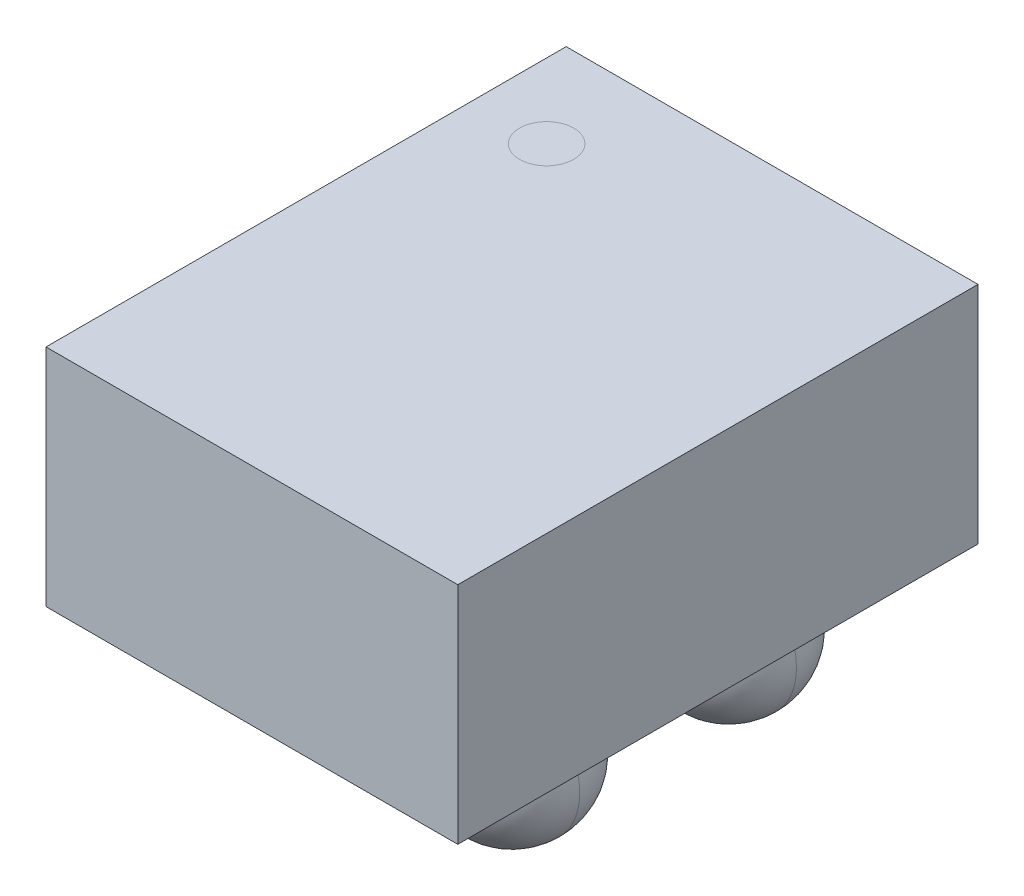
ISO-10303-21;
HEADER;
FILE_DESCRIPTION(('STEP AP214'),'2;1');
FILE_NAME('part.step','',(''),(''),'','','');
FILE_SCHEMA(('AUTOMOTIVE_DESIGN { 1 0 10303 214 1 1 1 1 }'));
ENDSEC;
DATA;
#1=APPLICATION_CONTEXT('core data for automotive mechanical design processes');
#2=APPLICATION_PROTOCOL_DEFINITION('international standard','automotive_design',2000,#1);
#3=PRODUCT_CONTEXT('',#1,'mechanical');
#4=PRODUCT('Part','Part','',(#3));
#5=PRODUCT_RELATED_PRODUCT_CATEGORY('part','',(#4));
#6=PRODUCT_DEFINITION_FORMATION('','',#4);
#7=PRODUCT_DEFINITION_CONTEXT('part definition',#1,'design');
#8=PRODUCT_DEFINITION('design','',#6,#7);
#9=PRODUCT_DEFINITION_SHAPE('','',#8);
#10=(LENGTH_UNIT() NAMED_UNIT(*) SI_UNIT(.MILLI.,.METRE.));
#11=(NAMED_UNIT(*) PLANE_ANGLE_UNIT() SI_UNIT($,.RADIAN.));
#12=(NAMED_UNIT(*) SI_UNIT($,.STERADIAN.) SOLID_ANGLE_UNIT());
#13=UNCERTAINTY_MEASURE_WITH_UNIT(LENGTH_MEASURE(1.E-05),#10,'distance_accuracy_value','');
#14=(GEOMETRIC_REPRESENTATION_CONTEXT(3) GLOBAL_UNCERTAINTY_ASSIGNED_CONTEXT((#13)) GLOBAL_UNIT_ASSIGNED_CONTEXT((#10,
#11,#12)) REPRESENTATION_CONTEXT('',''));
#15=CARTESIAN_POINT('',(0.,0.,0.));
#16=DIRECTION('',(0.,0.,1.));
#17=DIRECTION('',(1.,0.,0.));
#18=AXIS2_PLACEMENT_3D('',#15,#16,#17);
#19=CARTESIAN_POINT('',(-0.2,0.125,-0.2));
#20=DIRECTION('',(0.,0.,1.));
#21=DIRECTION('',(-1.,0.,0.));
#22=AXIS2_PLACEMENT_3D('',#19,#20,#21);
#23=SPHERICAL_SURFACE('',#22,0.125);
#24=CARTESIAN_POINT('',(-0.2,0.125,-0.2));
#25=DIRECTION('',(0.,0.,1.));
#26=DIRECTION('',(1.,0.,0.));
#27=AXIS2_PLACEMENT_3D('',#24,#25,#26);
#28=CIRCLE('',#27,0.125);
#29=CARTESIAN_POINT('',(-0.2,0.,-0.2));
#30=VERTEX_POINT('',#29);
#31=CARTESIAN_POINT('',(-0.108348486101,0.21,-0.2));
#32=VERTEX_POINT('',#31);
#33=EDGE_CURVE('P0_E69',#30,#32,#28,.T.);
#34=ORIENTED_EDGE('',*,*,#33,.F.);
#35=CARTESIAN_POINT('',(-0.2,0.125,-0.2));
#36=DIRECTION('',(0.,0.,-1.));
#37=DIRECTION('',(-1.,0.,0.));
#38=AXIS2_PLACEMENT_3D('',#35,#36,#37);
#39=CIRCLE('',#38,0.125);
#40=CARTESIAN_POINT('',(-0.325,0.125,-0.2));
#41=VERTEX_POINT('',#40);
#42=EDGE_CURVE('P0_E66',#30,#41,#39,.T.);
#43=ORIENTED_EDGE('',*,*,#42,.T.);
#44=CARTESIAN_POINT('',(-0.2,0.125,-0.325));
#45=CARTESIAN_POINT('',(-0.23926990817,0.125,-0.325));
#46=CARTESIAN_POINT('',(-0.27857645542,0.125,-0.309623124494));
#47=CARTESIAN_POINT('',(-0.309623124494,0.125,-0.27857645542));
#48=CARTESIAN_POINT('',(-0.325,0.125,-0.23926990817));
#49=CARTESIAN_POINT('',(-0.325,0.125,-0.2));
#50=(BOUNDED_CURVE() B_SPLINE_CURVE(5,(#44,#45,#46,#47,#48,#49),.UNSPECIFIED.,.F.,
.F.) B_SPLINE_CURVE_WITH_KNOTS((6,6),(-1.570796326795,0.),
.UNSPECIFIED.) CURVE() GEOMETRIC_REPRESENTATION_ITEM() RATIONAL_B_SPLINE_CURVE((1.,1.,1.,1.,1.,1.)) REPRESENTATION_ITEM(''));
#51=CARTESIAN_POINT('',(-0.2,0.125,-0.325));
#52=VERTEX_POINT('',#51);
#53=EDGE_CURVE('P0_E11',#52,#41,#50,.T.);
#54=ORIENTED_EDGE('',*,*,#53,.F.);
#55=ORIENTED_EDGE('',*,*,#53,.T.);
#56=CARTESIAN_POINT('',(-0.2,0.125,-0.2));
#57=DIRECTION('',(0.,0.,-1.));
#58=DIRECTION('',(-1.,0.,0.));
#59=AXIS2_PLACEMENT_3D('',#56,#57,#58);
#60=CIRCLE('',#59,0.125);
#61=CARTESIAN_POINT('',(-0.291651513899,0.21,-0.2));
#62=VERTEX_POINT('',#61);
#63=EDGE_CURVE('P0_E64',#41,#62,#60,.T.);
#64=ORIENTED_EDGE('',*,*,#63,.T.);
#65=CARTESIAN_POINT('',(-0.2,0.21,-0.2));
#66=DIRECTION('',(0.,1.,0.));
#67=DIRECTION('',(0.,0.,1.));
#68=AXIS2_PLACEMENT_3D('',#65,#66,#67);
#69=CIRCLE('',#68,0.09165151389912);
#70=EDGE_CURVE('P0_E28',#32,#62,#69,.T.);
#71=ORIENTED_EDGE('',*,*,#70,.F.);
#72=EDGE_LOOP('',(#34,#43,#54,#55,#64,#71));
#73=FACE_BOUND('',#72,.T.);
#74=ADVANCED_FACE('P0_F17',(#73),#23,.T.);
#75=CARTESIAN_POINT('',(-0.2,0.21,-0.2));
#76=DIRECTION('',(0.,1.,0.));
#77=DIRECTION('',(1.,0.,0.));
#78=AXIS2_PLACEMENT_3D('',#75,#76,#77);
#79=PLANE('',#78);
#80=CARTESIAN_POINT('',(-0.2,0.21,-0.2));
#81=DIRECTION('',(0.,1.,0.));
#82=DIRECTION('',(0.,0.,1.));
#83=AXIS2_PLACEMENT_3D('',#80,#81,#82);
#84=CIRCLE('',#83,0.09165151389912);
#85=EDGE_CURVE('P0_E75',#62,#32,#84,.T.);
#86=ORIENTED_EDGE('',*,*,#85,.T.);
#87=ORIENTED_EDGE('',*,*,#70,.T.);
#88=EDGE_LOOP('',(#86,#87));
#89=FACE_BOUND('',#88,.T.);
#90=ADVANCED_FACE('P0_F108',(#89),#79,.T.);
#91=CARTESIAN_POINT('',(-0.2,0.125,-0.2));
#92=DIRECTION('',(0.,0.,1.));
#93=DIRECTION('',(-1.,0.,0.));
#94=AXIS2_PLACEMENT_3D('',#91,#92,#93);
#95=SPHERICAL_SURFACE('',#94,0.125);
#96=ORIENTED_EDGE('',*,*,#63,.F.);
#97=CARTESIAN_POINT('',(-0.325,0.125,-0.2));
#98=CARTESIAN_POINT('',(-0.325,0.125,-0.16073009183));
#99=CARTESIAN_POINT('',(-0.309623124494,0.125,-0.12142354458));
#100=CARTESIAN_POINT('',(-0.27857645542,0.125,-0.09037687550572));
#101=CARTESIAN_POINT('',(-0.23926990817,0.125,-0.075));
#102=CARTESIAN_POINT('',(-0.2,0.125,-0.075));
#103=(BOUNDED_CURVE() B_SPLINE_CURVE(5,(#97,#98,#99,#100,#101,#102),.UNSPECIFIED.,.F.,
.F.) B_SPLINE_CURVE_WITH_KNOTS((6,6),(0.,1.570796326795),
.UNSPECIFIED.) CURVE() GEOMETRIC_REPRESENTATION_ITEM() RATIONAL_B_SPLINE_CURVE((1.,1.,1.,1.,1.,1.)) REPRESENTATION_ITEM(''));
#104=CARTESIAN_POINT('',(-0.2,0.125,-0.075));
#105=VERTEX_POINT('',#104);
#106=EDGE_CURVE('P0_E20',#41,#105,#103,.T.);
#107=ORIENTED_EDGE('',*,*,#106,.T.);
#108=ORIENTED_EDGE('',*,*,#106,.F.);
#109=ORIENTED_EDGE('',*,*,#42,.F.);
#110=ORIENTED_EDGE('',*,*,#33,.T.);
#111=ORIENTED_EDGE('',*,*,#85,.F.);
#112=EDGE_LOOP('',(#96,#107,#108,#109,#110,#111));
#113=FACE_BOUND('',#112,.T.);
#114=ADVANCED_FACE('P0_F73',(#113),#95,.T.);
#115=CLOSED_SHELL('',(#74,#90,#114));
#116=MANIFOLD_SOLID_BREP('P0_B1',#115);
#117=CARTESIAN_POINT('',(0.2,0.125,-0.2));
#118=DIRECTION('',(0.,0.,1.));
#119=DIRECTION('',(-1.,0.,0.));
#120=AXIS2_PLACEMENT_3D('',#117,#118,#119);
#121=SPHERICAL_SURFACE('',#120,0.125);
#122=CARTESIAN_POINT('',(0.2,0.125,-0.2));
#123=DIRECTION('',(0.,0.,1.));
#124=DIRECTION('',(1.,0.,0.));
#125=AXIS2_PLACEMENT_3D('',#122,#123,#124);
#126=CIRCLE('',#125,0.125);
#127=CARTESIAN_POINT('',(0.2,0.,-0.2));
#128=VERTEX_POINT('',#127);
#129=CARTESIAN_POINT('',(0.291651513899,0.21,-0.2));
#130=VERTEX_POINT('',#129);
#131=EDGE_CURVE('P1_E65',#128,#130,#126,.T.);
#132=ORIENTED_EDGE('',*,*,#131,.F.);
#133=CARTESIAN_POINT('',(0.2,0.125,-0.2));
#134=DIRECTION('',(0.,0.,-1.));
#135=DIRECTION('',(-1.,0.,0.));
#136=AXIS2_PLACEMENT_3D('',#133,#134,#135);
#137=CIRCLE('',#136,0.125);
#138=CARTESIAN_POINT('',(0.075,0.125,-0.2));
#139=VERTEX_POINT('',#138);
#140=EDGE_CURVE('P1_E62',#128,#139,#137,.T.);
#141=ORIENTED_EDGE('',*,*,#140,.T.);
#142=CARTESIAN_POINT('',(0.2,0.125,-0.325));
#143=CARTESIAN_POINT('',(0.16073009183,0.125,-0.325));
#144=CARTESIAN_POINT('',(0.12142354458,0.125,-0.309623124494));
#145=CARTESIAN_POINT('',(0.09037687550572,0.125,-0.27857645542));
#146=CARTESIAN_POINT('',(0.075,0.125,-0.23926990817));
#147=CARTESIAN_POINT('',(0.075,0.125,-0.2));
#148=(BOUNDED_CURVE() B_SPLINE_CURVE(5,(#142,#143,#144,#145,#146,#147),.UNSPECIFIED.,.F.,
.F.) B_SPLINE_CURVE_WITH_KNOTS((6,6),(-1.570796326795,0.),
.UNSPECIFIED.) CURVE() GEOMETRIC_REPRESENTATION_ITEM() RATIONAL_B_SPLINE_CURVE((1.,1.,1.,1.,1.,1.)) REPRESENTATION_ITEM(''));
#149=CARTESIAN_POINT('',(0.2,0.125,-0.325));
#150=VERTEX_POINT('',#149);
#151=EDGE_CURVE('P1_E11',#150,#139,#148,.T.);
#152=ORIENTED_EDGE('',*,*,#151,.F.);
#153=ORIENTED_EDGE('',*,*,#151,.T.);
#154=CARTESIAN_POINT('',(0.2,0.125,-0.2));
#155=DIRECTION('',(0.,0.,-1.));
#156=DIRECTION('',(-1.,0.,0.));
#157=AXIS2_PLACEMENT_3D('',#154,#155,#156);
#158=CIRCLE('',#157,0.125);
#159=CARTESIAN_POINT('',(0.108348486101,0.21,-0.2));
#160=VERTEX_POINT('',#159);
#161=EDGE_CURVE('P1_E60',#139,#160,#158,.T.);
#162=ORIENTED_EDGE('',*,*,#161,.T.);
#163=CARTESIAN_POINT('',(0.2,0.21,-0.2));
#164=DIRECTION('',(0.,1.,0.));
#165=DIRECTION('',(0.,0.,1.));
#166=AXIS2_PLACEMENT_3D('',#163,#164,#165);
#167=CIRCLE('',#166,0.09165151389912);
#168=EDGE_CURVE('P1_E29',#130,#160,#167,.T.);
#169=ORIENTED_EDGE('',*,*,#168,.F.);
#170=EDGE_LOOP('',(#132,#141,#152,#153,#162,#169));
#171=FACE_BOUND('',#170,.T.);
#172=ADVANCED_FACE('P1_F17',(#171),#121,.T.);
#173=CARTESIAN_POINT('',(0.2,0.21,-0.2));
#174=DIRECTION('',(0.,1.,0.));
#175=DIRECTION('',(1.,0.,0.));
#176=AXIS2_PLACEMENT_3D('',#173,#174,#175);
#177=PLANE('',#176);
#178=CARTESIAN_POINT('',(0.2,0.21,-0.2));
#179=DIRECTION('',(0.,1.,0.));
#180=DIRECTION('',(0.,0.,1.));
#181=AXIS2_PLACEMENT_3D('',#178,#179,#180);
#182=CIRCLE('',#181,0.09165151389912);
#183=EDGE_CURVE('P1_E71',#160,#130,#182,.T.);
#184=ORIENTED_EDGE('',*,*,#183,.T.);
#185=ORIENTED_EDGE('',*,*,#168,.T.);
#186=EDGE_LOOP('',(#184,#185));
#187=FACE_BOUND('',#186,.T.);
#188=ADVANCED_FACE('P1_F92',(#187),#177,.T.);
#189=CARTESIAN_POINT('',(0.2,0.125,-0.2));
#190=DIRECTION('',(0.,0.,1.));
#191=DIRECTION('',(-1.,0.,0.));
#192=AXIS2_PLACEMENT_3D('',#189,#190,#191);
#193=SPHERICAL_SURFACE('',#192,0.125);
#194=ORIENTED_EDGE('',*,*,#161,.F.);
#195=CARTESIAN_POINT('',(0.075,0.125,-0.2));
#196=CARTESIAN_POINT('',(0.075,0.125,-0.16073009183));
#197=CARTESIAN_POINT('',(0.09037687550572,0.125,-0.12142354458));
#198=CARTESIAN_POINT('',(0.12142354458,0.125,-0.09037687550572));
#199=CARTESIAN_POINT('',(0.16073009183,0.125,-0.075));
#200=CARTESIAN_POINT('',(0.2,0.125,-0.075));
#201=(BOUNDED_CURVE() B_SPLINE_CURVE(5,(#195,#196,#197,#198,#199,#200),.UNSPECIFIED.,.F.,
.F.) B_SPLINE_CURVE_WITH_KNOTS((6,6),(0.,1.570796326795),
.UNSPECIFIED.) CURVE() GEOMETRIC_REPRESENTATION_ITEM() RATIONAL_B_SPLINE_CURVE((1.,1.,1.,1.,1.,1.)) REPRESENTATION_ITEM(''));
#202=CARTESIAN_POINT('',(0.2,0.125,-0.075));
#203=VERTEX_POINT('',#202);
#204=EDGE_CURVE('P1_E20',#139,#203,#201,.T.);
#205=ORIENTED_EDGE('',*,*,#204,.T.);
#206=ORIENTED_EDGE('',*,*,#204,.F.);
#207=ORIENTED_EDGE('',*,*,#140,.F.);
#208=ORIENTED_EDGE('',*,*,#131,.T.);
#209=ORIENTED_EDGE('',*,*,#183,.F.);
#210=EDGE_LOOP('',(#194,#205,#206,#207,#208,#209));
#211=FACE_BOUND('',#210,.T.);
#212=ADVANCED_FACE('P1_F69',(#211),#193,.T.);
#213=CLOSED_SHELL('',(#172,#188,#212));
#214=MANIFOLD_SOLID_BREP('P1_B1',#213);
#215=CARTESIAN_POINT('',(-0.2,0.125,0.2));
#216=DIRECTION('',(0.,0.,1.));
#217=DIRECTION('',(-1.,0.,0.));
#218=AXIS2_PLACEMENT_3D('',#215,#216,#217);
#219=SPHERICAL_SURFACE('',#218,0.125);
#220=CARTESIAN_POINT('',(-0.2,0.125,0.2));
#221=DIRECTION('',(0.,0.,1.));
#222=DIRECTION('',(1.,0.,0.));
#223=AXIS2_PLACEMENT_3D('',#220,#221,#222);
#224=CIRCLE('',#223,0.125);
#225=CARTESIAN_POINT('',(-0.2,0.,0.2));
#226=VERTEX_POINT('',#225);
#227=CARTESIAN_POINT('',(-0.108348486101,0.21,0.2));
#228=VERTEX_POINT('',#227);
#229=EDGE_CURVE('P2_E53',#226,#228,#224,.T.);
#230=ORIENTED_EDGE('',*,*,#229,.F.);
#231=CARTESIAN_POINT('',(-0.2,0.125,0.2));
#232=DIRECTION('',(0.,0.,-1.));
#233=DIRECTION('',(-1.,0.,0.));
#234=AXIS2_PLACEMENT_3D('',#231,#232,#233);
#235=CIRCLE('',#234,0.125);
#236=CARTESIAN_POINT('',(-0.325,0.125,0.2));
#237=VERTEX_POINT('',#236);
#238=EDGE_CURVE('P2_E66',#226,#237,#235,.T.);
#239=ORIENTED_EDGE('',*,*,#238,.T.);
#240=CARTESIAN_POINT('',(-0.2,0.125,0.075));
#241=CARTESIAN_POINT('',(-0.23926990817,0.125,0.075));
#242=CARTESIAN_POINT('',(-0.27857645542,0.125,0.09037687550572));
#243=CARTESIAN_POINT('',(-0.309623124494,0.125,0.12142354458));
#244=CARTESIAN_POINT('',(-0.325,0.125,0.16073009183));
#245=CARTESIAN_POINT('',(-0.325,0.125,0.2));
#246=(BOUNDED_CURVE() B_SPLINE_CURVE(5,(#240,#241,#242,#243,#244,#245),.UNSPECIFIED.,.F.,
.F.) B_SPLINE_CURVE_WITH_KNOTS((6,6),(-1.570796326795,0.),
.UNSPECIFIED.) CURVE() GEOMETRIC_REPRESENTATION_ITEM() RATIONAL_B_SPLINE_CURVE((1.,1.,1.,1.,1.,1.)) REPRESENTATION_ITEM(''));
#247=CARTESIAN_POINT('',(-0.2,0.125,0.075));
#248=VERTEX_POINT('',#247);
#249=EDGE_CURVE('P2_E11',#248,#237,#246,.T.);
#250=ORIENTED_EDGE('',*,*,#249,.F.);
#251=ORIENTED_EDGE('',*,*,#249,.T.);
#252=CARTESIAN_POINT('',(-0.2,0.125,0.2));
#253=DIRECTION('',(0.,0.,-1.));
#254=DIRECTION('',(-1.,0.,0.));
#255=AXIS2_PLACEMENT_3D('',#252,#253,#254);
#256=CIRCLE('',#255,0.125);
#257=CARTESIAN_POINT('',(-0.291651513899,0.21,0.2));
#258=VERTEX_POINT('',#257);
#259=EDGE_CURVE('P2_E20',#237,#258,#256,.T.);
#260=ORIENTED_EDGE('',*,*,#259,.T.);
#261=CARTESIAN_POINT('',(-0.2,0.21,0.2));
#262=DIRECTION('',(0.,1.,0.));
#263=DIRECTION('',(0.,0.,1.));
#264=AXIS2_PLACEMENT_3D('',#261,#262,#263);
#265=CIRCLE('',#264,0.09165151389912);
#266=EDGE_CURVE('P2_E27',#228,#258,#265,.T.);
#267=ORIENTED_EDGE('',*,*,#266,.F.);
#268=EDGE_LOOP('',(#230,#239,#250,#251,#260,#267));
#269=FACE_BOUND('',#268,.T.);
#270=ADVANCED_FACE('P2_F17',(#269),#219,.T.);
#271=CARTESIAN_POINT('',(-0.2,0.21,0.2));
#272=DIRECTION('',(0.,1.,0.));
#273=DIRECTION('',(1.,0.,0.));
#274=AXIS2_PLACEMENT_3D('',#271,#272,#273);
#275=PLANE('',#274);
#276=CARTESIAN_POINT('',(-0.2,0.21,0.2));
#277=DIRECTION('',(0.,1.,0.));
#278=DIRECTION('',(0.,0.,1.));
#279=AXIS2_PLACEMENT_3D('',#276,#277,#278);
#280=CIRCLE('',#279,0.09165151389912);
#281=EDGE_CURVE('P2_E82',#258,#228,#280,.T.);
#282=ORIENTED_EDGE('',*,*,#281,.T.);
#283=ORIENTED_EDGE('',*,*,#266,.T.);
#284=EDGE_LOOP('',(#282,#283));
#285=FACE_BOUND('',#284,.T.);
#286=ADVANCED_FACE('P2_F94',(#285),#275,.T.);
#287=CARTESIAN_POINT('',(-0.2,0.125,0.2));
#288=DIRECTION('',(0.,0.,1.));
#289=DIRECTION('',(-1.,0.,0.));
#290=AXIS2_PLACEMENT_3D('',#287,#288,#289);
#291=SPHERICAL_SURFACE('',#290,0.125);
#292=ORIENTED_EDGE('',*,*,#259,.F.);
#293=CARTESIAN_POINT('',(-0.325,0.125,0.2));
#294=CARTESIAN_POINT('',(-0.325,0.125,0.23926990817));
#295=CARTESIAN_POINT('',(-0.309623124494,0.125,0.27857645542));
#296=CARTESIAN_POINT('',(-0.27857645542,0.125,0.309623124494));
#297=CARTESIAN_POINT('',(-0.23926990817,0.125,0.325));
#298=CARTESIAN_POINT('',(-0.2,0.125,0.325));
#299=(BOUNDED_CURVE() B_SPLINE_CURVE(5,(#293,#294,#295,#296,#297,#298),.UNSPECIFIED.,.F.,
.F.) B_SPLINE_CURVE_WITH_KNOTS((6,6),(0.,1.570796326795),
.UNSPECIFIED.) CURVE() GEOMETRIC_REPRESENTATION_ITEM() RATIONAL_B_SPLINE_CURVE((1.,1.,1.,1.,1.,1.)) REPRESENTATION_ITEM(''));
#300=CARTESIAN_POINT('',(-0.2,0.125,0.325));
#301=VERTEX_POINT('',#300);
#302=EDGE_CURVE('P2_E61',#237,#301,#299,.T.);
#303=ORIENTED_EDGE('',*,*,#302,.T.);
#304=ORIENTED_EDGE('',*,*,#302,.F.);
#305=ORIENTED_EDGE('',*,*,#238,.F.);
#306=ORIENTED_EDGE('',*,*,#229,.T.);
#307=ORIENTED_EDGE('',*,*,#281,.F.);
#308=EDGE_LOOP('',(#292,#303,#304,#305,#306,#307));
#309=FACE_BOUND('',#308,.T.);
#310=ADVANCED_FACE('P2_F62',(#309),#291,.T.);
#311=CLOSED_SHELL('',(#270,#286,#310));
#312=MANIFOLD_SOLID_BREP('P2_B1',#311);
#313=CARTESIAN_POINT('',(0.2,0.125,0.2));
#314=DIRECTION('',(0.,0.,1.));
#315=DIRECTION('',(-1.,0.,0.));
#316=AXIS2_PLACEMENT_3D('',#313,#314,#315);
#317=SPHERICAL_SURFACE('',#316,0.125);
#318=CARTESIAN_POINT('',(0.2,0.125,0.2));
#319=DIRECTION('',(0.,0.,1.));
#320=DIRECTION('',(1.,0.,0.));
#321=AXIS2_PLACEMENT_3D('',#318,#319,#320);
#322=CIRCLE('',#321,0.125);
#323=CARTESIAN_POINT('',(0.2,0.,0.2));
#324=VERTEX_POINT('',#323);
#325=CARTESIAN_POINT('',(0.291651513899,0.21,0.2));
#326=VERTEX_POINT('',#325);
#327=EDGE_CURVE('P3_E66',#324,#326,#322,.T.);
#328=ORIENTED_EDGE('',*,*,#327,.F.);
#329=CARTESIAN_POINT('',(0.2,0.125,0.2));
#330=DIRECTION('',(0.,0.,-1.));
#331=DIRECTION('',(-1.,0.,0.));
#332=AXIS2_PLACEMENT_3D('',#329,#330,#331);
#333=CIRCLE('',#332,0.125);
#334=CARTESIAN_POINT('',(0.075,0.125,0.2));
#335=VERTEX_POINT('',#334);
#336=EDGE_CURVE('P3_E68',#324,#335,#333,.T.);
#337=ORIENTED_EDGE('',*,*,#336,.T.);
#338=CARTESIAN_POINT('',(0.2,0.125,0.075));
#339=CARTESIAN_POINT('',(0.16073009183,0.125,0.075));
#340=CARTESIAN_POINT('',(0.12142354458,0.125,0.09037687550572));
#341=CARTESIAN_POINT('',(0.09037687550572,0.125,0.12142354458));
#342=CARTESIAN_POINT('',(0.075,0.125,0.16073009183));
#343=CARTESIAN_POINT('',(0.075,0.125,0.2));
#344=(BOUNDED_CURVE() B_SPLINE_CURVE(5,(#338,#339,#340,#341,#342,#343),.UNSPECIFIED.,.F.,
.F.) B_SPLINE_CURVE_WITH_KNOTS((6,6),(-1.570796326795,0.),
.UNSPECIFIED.) CURVE() GEOMETRIC_REPRESENTATION_ITEM() RATIONAL_B_SPLINE_CURVE((1.,1.,1.,1.,1.,1.)) REPRESENTATION_ITEM(''));
#345=CARTESIAN_POINT('',(0.2,0.125,0.075));
#346=VERTEX_POINT('',#345);
#347=EDGE_CURVE('P3_E11',#346,#335,#344,.T.);
#348=ORIENTED_EDGE('',*,*,#347,.F.);
#349=ORIENTED_EDGE('',*,*,#347,.T.);
#350=CARTESIAN_POINT('',(0.2,0.125,0.2));
#351=DIRECTION('',(0.,0.,-1.));
#352=DIRECTION('',(-1.,0.,0.));
#353=AXIS2_PLACEMENT_3D('',#350,#351,#352);
#354=CIRCLE('',#353,0.125);
#355=CARTESIAN_POINT('',(0.108348486101,0.21,0.2));
#356=VERTEX_POINT('',#355);
#357=EDGE_CURVE('P3_E79',#335,#356,#354,.T.);
#358=ORIENTED_EDGE('',*,*,#357,.T.);
#359=CARTESIAN_POINT('',(0.2,0.21,0.2));
#360=DIRECTION('',(0.,1.,0.));
#361=DIRECTION('',(0.,0.,1.));
#362=AXIS2_PLACEMENT_3D('',#359,#360,#361);
#363=CIRCLE('',#362,0.09165151389912);
#364=EDGE_CURVE('P3_E21',#326,#356,#363,.T.);
#365=ORIENTED_EDGE('',*,*,#364,.F.);
#366=EDGE_LOOP('',(#328,#337,#348,#349,#358,#365));
#367=FACE_BOUND('',#366,.T.);
#368=ADVANCED_FACE('P3_F17',(#367),#317,.T.);
#369=CARTESIAN_POINT('',(0.2,0.21,0.2));
#370=DIRECTION('',(0.,1.,0.));
#371=DIRECTION('',(1.,0.,0.));
#372=AXIS2_PLACEMENT_3D('',#369,#370,#371);
#373=PLANE('',#372);
#374=CARTESIAN_POINT('',(0.2,0.21,0.2));
#375=DIRECTION('',(0.,1.,0.));
#376=DIRECTION('',(0.,0.,1.));
#377=AXIS2_PLACEMENT_3D('',#374,#375,#376);
#378=CIRCLE('',#377,0.09165151389912);
#379=EDGE_CURVE('P3_E70',#356,#326,#378,.T.);
#380=ORIENTED_EDGE('',*,*,#379,.T.);
#381=ORIENTED_EDGE('',*,*,#364,.T.);
#382=EDGE_LOOP('',(#380,#381));
#383=FACE_BOUND('',#382,.T.);
#384=ADVANCED_FACE('P3_F19',(#383),#373,.T.);
#385=CARTESIAN_POINT('',(0.2,0.125,0.2));
#386=DIRECTION('',(0.,0.,1.));
#387=DIRECTION('',(-1.,0.,0.));
#388=AXIS2_PLACEMENT_3D('',#385,#386,#387);
#389=SPHERICAL_SURFACE('',#388,0.125);
#390=ORIENTED_EDGE('',*,*,#357,.F.);
#391=CARTESIAN_POINT('',(0.075,0.125,0.2));
#392=CARTESIAN_POINT('',(0.075,0.125,0.23926990817));
#393=CARTESIAN_POINT('',(0.09037687550572,0.125,0.27857645542));
#394=CARTESIAN_POINT('',(0.12142354458,0.125,0.309623124494));
#395=CARTESIAN_POINT('',(0.16073009183,0.125,0.325));
#396=CARTESIAN_POINT('',(0.2,0.125,0.325));
#397=(BOUNDED_CURVE() B_SPLINE_CURVE(5,(#391,#392,#393,#394,#395,#396),.UNSPECIFIED.,.F.,
.F.) B_SPLINE_CURVE_WITH_KNOTS((6,6),(0.,1.570796326795),
.UNSPECIFIED.) CURVE() GEOMETRIC_REPRESENTATION_ITEM() RATIONAL_B_SPLINE_CURVE((1.,1.,1.,1.,1.,1.)) REPRESENTATION_ITEM(''));
#398=CARTESIAN_POINT('',(0.2,0.125,0.325));
#399=VERTEX_POINT('',#398);
#400=EDGE_CURVE('P3_E62',#335,#399,#397,.T.);
#401=ORIENTED_EDGE('',*,*,#400,.T.);
#402=ORIENTED_EDGE('',*,*,#400,.F.);
#403=ORIENTED_EDGE('',*,*,#336,.F.);
#404=ORIENTED_EDGE('',*,*,#327,.T.);
#405=ORIENTED_EDGE('',*,*,#379,.F.);
#406=EDGE_LOOP('',(#390,#401,#402,#403,#404,#405));
#407=FACE_BOUND('',#406,.T.);
#408=ADVANCED_FACE('P3_F72',(#407),#389,.T.);
#409=CLOSED_SHELL('',(#368,#384,#408));
#410=MANIFOLD_SOLID_BREP('P3_B1',#409);
#411=CARTESIAN_POINT('',(-0.242826443638,0.525,-0.306728139332));
#412=DIRECTION('',(0.,1.,0.));
#413=DIRECTION('',(1.,0.,0.));
#414=AXIS2_PLACEMENT_3D('',#411,#412,#413);
#415=PLANE('',#414);
#416=CARTESIAN_POINT('',(-0.242826443638,0.525,-0.306728139332));
#417=DIRECTION('',(0.,1.,0.));
#418=DIRECTION('',(0.,0.,1.));
#419=AXIS2_PLACEMENT_3D('',#416,#417,#418);
#420=CIRCLE('',#419,0.05);
#421=CARTESIAN_POINT('',(-0.242826443638,0.525,-0.256728139332));
#422=VERTEX_POINT('',#421);
#423=CARTESIAN_POINT('',(-0.242826443638,0.525,-0.356728139332));
#424=VERTEX_POINT('',#423);
#425=EDGE_CURVE('P4_E11',#422,#424,#420,.T.);
#426=ORIENTED_EDGE('',*,*,#425,.T.);
#427=CARTESIAN_POINT('',(-0.242826443638,0.525,-0.306728139332));
#428=DIRECTION('',(0.,1.,0.));
#429=DIRECTION('',(0.,0.,1.));
#430=AXIS2_PLACEMENT_3D('',#427,#428,#429);
#431=CIRCLE('',#430,0.05);
#432=EDGE_CURVE('P4_E106',#424,#422,#431,.T.);
#433=ORIENTED_EDGE('',*,*,#432,.T.);
#434=EDGE_LOOP('',(#426,#433));
#435=FACE_BOUND('',#434,.T.);
#436=ADVANCED_FACE('P4_F17',(#435),#415,.T.);
#437=CARTESIAN_POINT('',(-0.242826443638,0.525,-0.306728139332));
#438=DIRECTION('',(0.,1.,0.));
#439=DIRECTION('',(0.,0.,1.));
#440=AXIS2_PLACEMENT_3D('',#437,#438,#439);
#441=CYLINDRICAL_SURFACE('',#440,0.05);
#442=DIRECTION('',(0.,1.,0.));
#443=VECTOR('',#442,1.);
#444=CARTESIAN_POINT('',(-0.242826443638,0.525,-0.356728139332));
#445=LINE('',#444,#443);
#446=CARTESIAN_POINT('',(-0.242826443638,0.625,-0.356728139332));
#447=VERTEX_POINT('',#446);
#448=EDGE_CURVE('P4_E110',#424,#447,#445,.T.);
#449=ORIENTED_EDGE('',*,*,#448,.F.);
#450=ORIENTED_EDGE('',*,*,#425,.F.);
#451=DIRECTION('',(0.,1.,0.));
#452=VECTOR('',#451,1.);
#453=CARTESIAN_POINT('',(-0.242826443638,0.525,-0.256728139332));
#454=LINE('',#453,#452);
#455=CARTESIAN_POINT('',(-0.242826443638,0.625,-0.256728139332));
#456=VERTEX_POINT('',#455);
#457=EDGE_CURVE('P4_E116',#422,#456,#454,.T.);
#458=ORIENTED_EDGE('',*,*,#457,.T.);
#459=CARTESIAN_POINT('',(-0.242826443638,0.625,-0.306728139332));
#460=DIRECTION('',(0.,1.,0.));
#461=DIRECTION('',(0.,0.,1.));
#462=AXIS2_PLACEMENT_3D('',#459,#460,#461);
#463=CIRCLE('',#462,0.05);
#464=EDGE_CURVE('P4_E28',#456,#447,#463,.T.);
#465=ORIENTED_EDGE('',*,*,#464,.T.);
#466=EDGE_LOOP('',(#449,#450,#458,#465));
#467=FACE_BOUND('',#466,.T.);
#468=ADVANCED_FACE('P4_F173',(#467),#441,.F.);
#469=CARTESIAN_POINT('',(0.,0.625,0.));
#470=DIRECTION('',(0.,1.,0.));
#471=DIRECTION('',(1.,0.,0.));
#472=AXIS2_PLACEMENT_3D('',#469,#470,#471);
#473=PLANE('',#472);
#474=DIRECTION('',(0.,0.,1.));
#475=VECTOR('',#474,1.);
#476=CARTESIAN_POINT('',(-0.38,0.625,0.48));
#477=LINE('',#476,#475);
#478=CARTESIAN_POINT('',(-0.38,0.625,-0.48));
#479=VERTEX_POINT('',#478);
#480=CARTESIAN_POINT('',(-0.38,0.625,0.48));
#481=VERTEX_POINT('',#480);
#482=EDGE_CURVE('P4_E103',#479,#481,#477,.T.);
#483=ORIENTED_EDGE('',*,*,#482,.T.);
#484=DIRECTION('',(1.,0.,0.));
#485=VECTOR('',#484,1.);
#486=CARTESIAN_POINT('',(-0.38,0.625,0.48));
#487=LINE('',#486,#485);
#488=CARTESIAN_POINT('',(0.38,0.625,0.48));
#489=VERTEX_POINT('',#488);
#490=EDGE_CURVE('P4_E111',#481,#489,#487,.T.);
#491=ORIENTED_EDGE('',*,*,#490,.T.);
#492=DIRECTION('',(0.,0.,-1.));
#493=VECTOR('',#492,1.);
#494=CARTESIAN_POINT('',(0.38,0.625,0.48));
#495=LINE('',#494,#493);
#496=CARTESIAN_POINT('',(0.38,0.625,-0.48));
#497=VERTEX_POINT('',#496);
#498=EDGE_CURVE('P4_E95',#489,#497,#495,.T.);
#499=ORIENTED_EDGE('',*,*,#498,.T.);
#500=DIRECTION('',(-1.,0.,0.));
#501=VECTOR('',#500,1.);
#502=CARTESIAN_POINT('',(-0.38,0.625,-0.48));
#503=LINE('',#502,#501);
#504=EDGE_CURVE('P4_E73',#497,#479,#503,.T.);
#505=ORIENTED_EDGE('',*,*,#504,.T.);
#506=EDGE_LOOP('',(#483,#491,#499,#505));
#507=FACE_BOUND('',#506,.T.);
#508=ORIENTED_EDGE('',*,*,#464,.F.);
#509=CARTESIAN_POINT('',(-0.242826443638,0.625,-0.306728139332));
#510=DIRECTION('',(0.,1.,0.));
#511=DIRECTION('',(0.,0.,1.));
#512=AXIS2_PLACEMENT_3D('',#509,#510,#511);
#513=CIRCLE('',#512,0.05);
#514=EDGE_CURVE('P4_E117',#447,#456,#513,.T.);
#515=ORIENTED_EDGE('',*,*,#514,.F.);
#516=EDGE_LOOP('',(#508,#515));
#517=FACE_BOUND('',#516,.T.);
#518=ADVANCED_FACE('P4_F149',(#507,#517),#473,.T.);
#519=CARTESIAN_POINT('',(0.,0.21,0.));
#520=DIRECTION('',(0.,1.,0.));
#521=DIRECTION('',(1.,0.,0.));
#522=AXIS2_PLACEMENT_3D('',#519,#520,#521);
#523=PLANE('',#522);
#524=DIRECTION('',(1.,0.,0.));
#525=VECTOR('',#524,1.);
#526=CARTESIAN_POINT('',(-0.38,0.21,0.48));
#527=LINE('',#526,#525);
#528=CARTESIAN_POINT('',(-0.38,0.21,0.48));
#529=VERTEX_POINT('',#528);
#530=CARTESIAN_POINT('',(0.38,0.21,0.48));
#531=VERTEX_POINT('',#530);
#532=EDGE_CURVE('P4_E123',#529,#531,#527,.T.);
#533=ORIENTED_EDGE('',*,*,#532,.F.);
#534=DIRECTION('',(0.,0.,1.));
#535=VECTOR('',#534,1.);
#536=CARTESIAN_POINT('',(-0.38,0.21,0.48));
#537=LINE('',#536,#535);
#538=CARTESIAN_POINT('',(-0.38,0.21,-0.48));
#539=VERTEX_POINT('',#538);
#540=EDGE_CURVE('P4_E42',#539,#529,#537,.T.);
#541=ORIENTED_EDGE('',*,*,#540,.F.);
#542=DIRECTION('',(-1.,0.,0.));
#543=VECTOR('',#542,1.);
#544=CARTESIAN_POINT('',(-0.38,0.21,-0.48));
#545=LINE('',#544,#543);
#546=CARTESIAN_POINT('',(0.38,0.21,-0.48));
#547=VERTEX_POINT('',#546);
#548=EDGE_CURVE('P4_E78',#547,#539,#545,.T.);
#549=ORIENTED_EDGE('',*,*,#548,.F.);
#550=DIRECTION('',(0.,0.,-1.));
#551=VECTOR('',#550,1.);
#552=CARTESIAN_POINT('',(0.38,0.21,0.48));
#553=LINE('',#552,#551);
#554=EDGE_CURVE('P4_E81',#531,#547,#553,.T.);
#555=ORIENTED_EDGE('',*,*,#554,.F.);
#556=EDGE_LOOP('',(#533,#541,#549,#555));
#557=FACE_BOUND('',#556,.T.);
#558=ADVANCED_FACE('P4_F79',(#557),#523,.F.);
#559=CARTESIAN_POINT('',(-0.38,2.474418229201,0.48));
#560=DIRECTION('',(1.,0.,0.));
#561=DIRECTION('',(0.,1.,0.));
#562=AXIS2_PLACEMENT_3D('',#559,#560,#561);
#563=PLANE('',#562);
#564=ORIENTED_EDGE('',*,*,#482,.F.);
#565=DIRECTION('',(0.,-1.,0.));
#566=VECTOR('',#565,1.);
#567=CARTESIAN_POINT('',(-0.38,2.474418229201,-0.48));
#568=LINE('',#567,#566);
#569=EDGE_CURVE('P4_E84',#479,#539,#568,.T.);
#570=ORIENTED_EDGE('',*,*,#569,.T.);
#571=ORIENTED_EDGE('',*,*,#540,.T.);
#572=DIRECTION('',(0.,-1.,0.));
#573=VECTOR('',#572,1.);
#574=CARTESIAN_POINT('',(-0.38,2.474418229201,0.48));
#575=LINE('',#574,#573);
#576=EDGE_CURVE('P4_E115',#481,#529,#575,.T.);
#577=ORIENTED_EDGE('',*,*,#576,.F.);
#578=EDGE_LOOP('',(#564,#570,#571,#577));
#579=FACE_BOUND('',#578,.T.);
#580=ADVANCED_FACE('P4_F19',(#579),#563,.F.);
#581=CARTESIAN_POINT('',(-0.38,2.474418229201,-0.48));
#582=DIRECTION('',(0.,0.,1.));
#583=DIRECTION('',(1.,0.,0.));
#584=AXIS2_PLACEMENT_3D('',#581,#582,#583);
#585=PLANE('',#584);
#586=ORIENTED_EDGE('',*,*,#504,.F.);
#587=DIRECTION('',(0.,-1.,0.));
#588=VECTOR('',#587,1.);
#589=CARTESIAN_POINT('',(0.38,2.474418229201,-0.48));
#590=LINE('',#589,#588);
#591=EDGE_CURVE('P4_E21',#497,#547,#590,.T.);
#592=ORIENTED_EDGE('',*,*,#591,.T.);
#593=ORIENTED_EDGE('',*,*,#548,.T.);
#594=ORIENTED_EDGE('',*,*,#569,.F.);
#595=EDGE_LOOP('',(#586,#592,#593,#594));
#596=FACE_BOUND('',#595,.T.);
#597=ADVANCED_FACE('P4_F86',(#596),#585,.F.);
#598=CARTESIAN_POINT('',(0.38,2.474418229201,0.48));
#599=DIRECTION('',(-1.,0.,0.));
#600=DIRECTION('',(0.,0.,1.));
#601=AXIS2_PLACEMENT_3D('',#598,#599,#600);
#602=PLANE('',#601);
#603=ORIENTED_EDGE('',*,*,#498,.F.);
#604=DIRECTION('',(0.,-1.,0.));
#605=VECTOR('',#604,1.);
#606=CARTESIAN_POINT('',(0.38,2.474418229201,0.48));
#607=LINE('',#606,#605);
#608=EDGE_CURVE('P4_E92',#489,#531,#607,.T.);
#609=ORIENTED_EDGE('',*,*,#608,.T.);
#610=ORIENTED_EDGE('',*,*,#554,.T.);
#611=ORIENTED_EDGE('',*,*,#591,.F.);
#612=EDGE_LOOP('',(#603,#609,#610,#611));
#613=FACE_BOUND('',#612,.T.);
#614=ADVANCED_FACE('P4_F90',(#613),#602,.F.);
#615=CARTESIAN_POINT('',(-0.38,2.474418229201,0.48));
#616=DIRECTION('',(0.,0.,-1.));
#617=DIRECTION('',(0.,-1.,0.));
#618=AXIS2_PLACEMENT_3D('',#615,#616,#617);
#619=PLANE('',#618);
#620=ORIENTED_EDGE('',*,*,#490,.F.);
#621=ORIENTED_EDGE('',*,*,#576,.T.);
#622=ORIENTED_EDGE('',*,*,#532,.T.);
#623=ORIENTED_EDGE('',*,*,#608,.F.);
#624=EDGE_LOOP('',(#620,#621,#622,#623));
#625=FACE_BOUND('',#624,.T.);
#626=ADVANCED_FACE('P4_F153',(#625),#619,.F.);
#627=CARTESIAN_POINT('',(-0.242826443638,0.525,-0.306728139332));
#628=DIRECTION('',(0.,1.,0.));
#629=DIRECTION('',(0.,0.,1.));
#630=AXIS2_PLACEMENT_3D('',#627,#628,#629);
#631=CYLINDRICAL_SURFACE('',#630,0.05);
#632=ORIENTED_EDGE('',*,*,#432,.F.);
#633=ORIENTED_EDGE('',*,*,#448,.T.);
#634=ORIENTED_EDGE('',*,*,#514,.T.);
#635=ORIENTED_EDGE('',*,*,#457,.F.);
#636=EDGE_LOOP('',(#632,#633,#634,#635));
#637=FACE_BOUND('',#636,.T.);
#638=ADVANCED_FACE('P4_F177',(#637),#631,.F.);
#639=CLOSED_SHELL('',(#436,#468,#518,#558,#580,#597,#614,#626,#638));
#640=MANIFOLD_SOLID_BREP('P4_B1',#639);
#641=CARTESIAN_POINT('',(-0.242826443638,0.525,-0.306728139332));
#642=DIRECTION('',(0.,1.,0.));
#643=DIRECTION('',(1.,0.,0.));
#644=AXIS2_PLACEMENT_3D('',#641,#642,#643);
#645=PLANE('',#644);
#646=CARTESIAN_POINT('',(-0.242826443638,0.525,-0.306728139332));
#647=DIRECTION('',(0.,-1.,0.));
#648=DIRECTION('',(0.,0.,1.));
#649=AXIS2_PLACEMENT_3D('',#646,#647,#648);
#650=CIRCLE('',#649,0.05);
#651=CARTESIAN_POINT('',(-0.242826443638,0.525,-0.256728139332));
#652=VERTEX_POINT('',#651);
#653=CARTESIAN_POINT('',(-0.242826443638,0.525,-0.356728139332));
#654=VERTEX_POINT('',#653);
#655=EDGE_CURVE('P5_E28',#652,#654,#650,.T.);
#656=ORIENTED_EDGE('',*,*,#655,.T.);
#657=CARTESIAN_POINT('',(-0.242826443638,0.525,-0.306728139332));
#658=DIRECTION('',(0.,-1.,0.));
#659=DIRECTION('',(0.,0.,1.));
#660=AXIS2_PLACEMENT_3D('',#657,#658,#659);
#661=CIRCLE('',#660,0.05);
#662=EDGE_CURVE('P5_E62',#654,#652,#661,.T.);
#663=ORIENTED_EDGE('',*,*,#662,.T.);
#664=EDGE_LOOP('',(#656,#663));
#665=FACE_BOUND('',#664,.T.);
#666=ADVANCED_FACE('P5_F17',(#665),#645,.F.);
#667=CARTESIAN_POINT('',(-0.242826443638,0.625,-0.306728139332));
#668=DIRECTION('',(0.,1.,0.));
#669=DIRECTION('',(1.,0.,0.));
#670=AXIS2_PLACEMENT_3D('',#667,#668,#669);
#671=PLANE('',#670);
#672=CARTESIAN_POINT('',(-0.242826443638,0.625,-0.306728139332));
#673=DIRECTION('',(0.,1.,0.));
#674=DIRECTION('',(0.,0.,1.));
#675=AXIS2_PLACEMENT_3D('',#672,#673,#674);
#676=CIRCLE('',#675,0.05);
#677=CARTESIAN_POINT('',(-0.242826443638,0.625,-0.256728139332));
#678=VERTEX_POINT('',#677);
#679=CARTESIAN_POINT('',(-0.242826443638,0.625,-0.356728139332));
#680=VERTEX_POINT('',#679);
#681=EDGE_CURVE('P5_E63',#678,#680,#676,.T.);
#682=ORIENTED_EDGE('',*,*,#681,.T.);
#683=CARTESIAN_POINT('',(-0.242826443638,0.625,-0.306728139332));
#684=DIRECTION('',(0.,1.,0.));
#685=DIRECTION('',(0.,0.,1.));
#686=AXIS2_PLACEMENT_3D('',#683,#684,#685);
#687=CIRCLE('',#686,0.05);
#688=EDGE_CURVE('P5_E11',#680,#678,#687,.T.);
#689=ORIENTED_EDGE('',*,*,#688,.T.);
#690=EDGE_LOOP('',(#682,#689));
#691=FACE_BOUND('',#690,.T.);
#692=ADVANCED_FACE('P5_F76',(#691),#671,.T.);
#693=CARTESIAN_POINT('',(-0.242826443638,0.383578643763,-0.306728139332));
#694=DIRECTION('',(0.,1.,0.));
#695=DIRECTION('',(0.,0.,1.));
#696=AXIS2_PLACEMENT_3D('',#693,#694,#695);
#697=CYLINDRICAL_SURFACE('',#696,0.05);
#698=DIRECTION('',(0.,1.,0.));
#699=VECTOR('',#698,1.);
#700=CARTESIAN_POINT('',(-0.242826443638,0.383578643763,-0.356728139332));
#701=LINE('',#700,#699);
#702=EDGE_CURVE('P5_E21',#654,#680,#701,.T.);
#703=ORIENTED_EDGE('',*,*,#702,.F.);
#704=ORIENTED_EDGE('',*,*,#655,.F.);
#705=DIRECTION('',(0.,1.,0.));
#706=VECTOR('',#705,1.);
#707=CARTESIAN_POINT('',(-0.242826443638,0.383578643763,-0.256728139332));
#708=LINE('',#707,#706);
#709=EDGE_CURVE('P5_E55',#652,#678,#708,.T.);
#710=ORIENTED_EDGE('',*,*,#709,.T.);
#711=ORIENTED_EDGE('',*,*,#688,.F.);
#712=EDGE_LOOP('',(#703,#704,#710,#711));
#713=FACE_BOUND('',#712,.T.);
#714=ADVANCED_FACE('P5_F54',(#713),#697,.T.);
#715=CARTESIAN_POINT('',(-0.242826443638,0.383578643763,-0.306728139332));
#716=DIRECTION('',(0.,1.,0.));
#717=DIRECTION('',(0.,0.,1.));
#718=AXIS2_PLACEMENT_3D('',#715,#716,#717);
#719=CYLINDRICAL_SURFACE('',#718,0.05);
#720=ORIENTED_EDGE('',*,*,#662,.F.);
#721=ORIENTED_EDGE('',*,*,#702,.T.);
#722=ORIENTED_EDGE('',*,*,#681,.F.);
#723=ORIENTED_EDGE('',*,*,#709,.F.);
#724=EDGE_LOOP('',(#720,#721,#722,#723));
#725=FACE_BOUND('',#724,.T.);
#726=ADVANCED_FACE('P5_F19',(#725),#719,.T.);
#727=CLOSED_SHELL('',(#666,#692,#714,#726));
#728=MANIFOLD_SOLID_BREP('P5_B1',#727);
#729=ADVANCED_BREP_SHAPE_REPRESENTATION('',(#18,#116,#214,#312,#410,#640,#728),#14);
#730=SHAPE_DEFINITION_REPRESENTATION(#9,#729);
ENDSEC;
END-ISO-10303-21;
